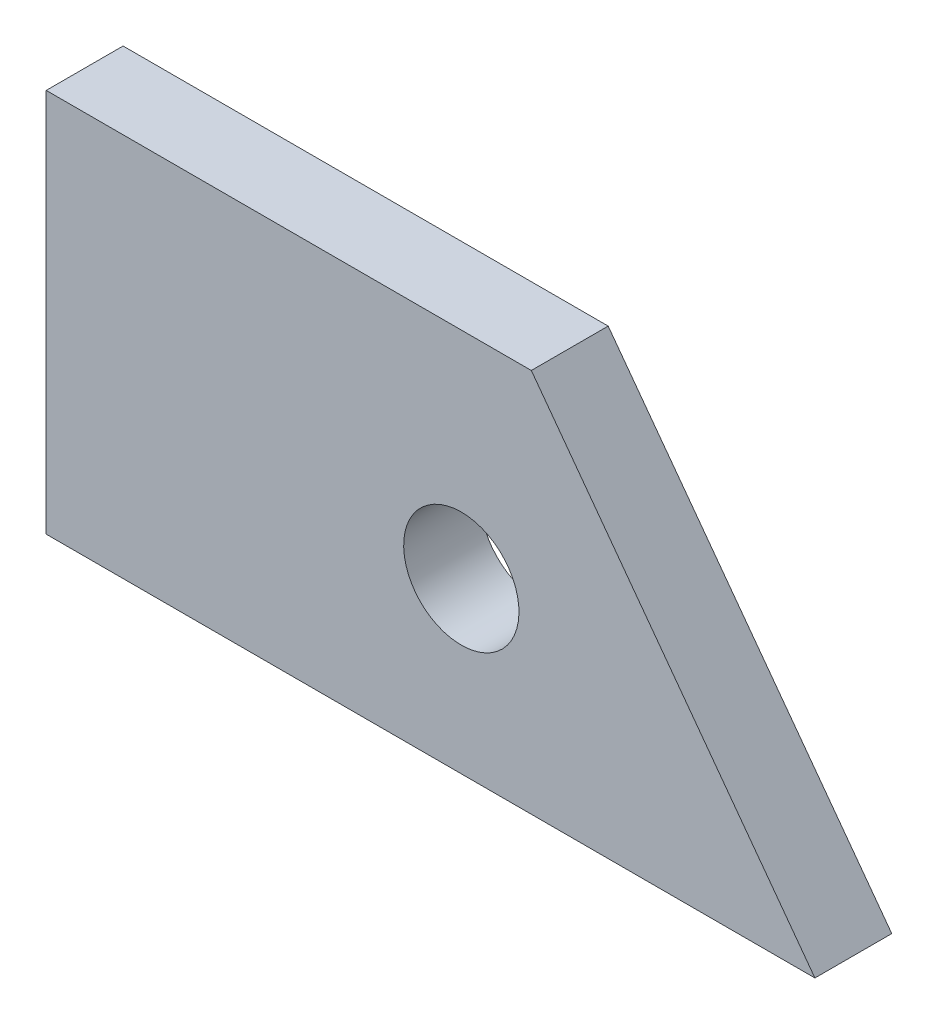
ISO-10303-21;
HEADER;
FILE_DESCRIPTION(('STEP AP214'),'2;1');
FILE_NAME('part.step','',(''),(''),'','','');
FILE_SCHEMA(('AUTOMOTIVE_DESIGN { 1 0 10303 214 1 1 1 1 }'));
ENDSEC;
DATA;
#1=APPLICATION_CONTEXT('core data for automotive mechanical design processes');
#2=APPLICATION_PROTOCOL_DEFINITION('international standard','automotive_design',2000,#1);
#3=PRODUCT_CONTEXT('',#1,'mechanical');
#4=PRODUCT('Part','Part','',(#3));
#5=PRODUCT_RELATED_PRODUCT_CATEGORY('part','',(#4));
#6=PRODUCT_DEFINITION_FORMATION('','',#4);
#7=PRODUCT_DEFINITION_CONTEXT('part definition',#1,'design');
#8=PRODUCT_DEFINITION('design','',#6,#7);
#9=PRODUCT_DEFINITION_SHAPE('','',#8);
#10=(LENGTH_UNIT() NAMED_UNIT(*) SI_UNIT(.MILLI.,.METRE.));
#11=(NAMED_UNIT(*) PLANE_ANGLE_UNIT() SI_UNIT($,.RADIAN.));
#12=(NAMED_UNIT(*) SI_UNIT($,.STERADIAN.) SOLID_ANGLE_UNIT());
#13=UNCERTAINTY_MEASURE_WITH_UNIT(LENGTH_MEASURE(1.E-05),#10,'distance_accuracy_value','');
#14=(GEOMETRIC_REPRESENTATION_CONTEXT(3) GLOBAL_UNCERTAINTY_ASSIGNED_CONTEXT((#13)) GLOBAL_UNIT_ASSIGNED_CONTEXT((#10,
#11,#12)) REPRESENTATION_CONTEXT('',''));
#15=CARTESIAN_POINT('',(0.,0.,0.));
#16=DIRECTION('',(0.,0.,1.));
#17=DIRECTION('',(1.,0.,0.));
#18=AXIS2_PLACEMENT_3D('',#15,#16,#17);
#19=CARTESIAN_POINT('',(114.,0.,-32.5));
#20=DIRECTION('',(0.,0.,1.));
#21=DIRECTION('',(0.,-1.,0.));
#22=AXIS2_PLACEMENT_3D('',#19,#20,#21);
#23=PLANE('',#22);
#24=DIRECTION('',(-1.,0.,0.));
#25=VECTOR('',#24,1.);
#26=CARTESIAN_POINT('',(114.,50.,-32.4999999999999));
#27=LINE('',#26,#25);
#28=CARTESIAN_POINT('',(77.1063365704997,50.,-32.4999999999998));
#29=VERTEX_POINT('',#28);
#30=CARTESIAN_POINT('',(14.,50.,-32.4999999999998));
#31=VERTEX_POINT('',#30);
#32=EDGE_CURVE('E44',#29,#31,#27,.T.);
#33=ORIENTED_EDGE('',*,*,#32,.F.);
#34=DIRECTION('',(-0.593736669502456,0.804659410737321,0.));
#35=VECTOR('',#34,1.);
#36=CARTESIAN_POINT('',(114.,0.,-32.5));
#37=LINE('',#36,#35);
#38=CARTESIAN_POINT('',(114.,0.,-32.5));
#39=VERTEX_POINT('',#38);
#40=EDGE_CURVE('E102',#39,#29,#37,.T.);
#41=ORIENTED_EDGE('',*,*,#40,.F.);
#42=DIRECTION('',(-1.,0.,0.));
#43=VECTOR('',#42,1.);
#44=CARTESIAN_POINT('',(114.,0.,-32.5));
#45=LINE('',#44,#43);
#46=CARTESIAN_POINT('',(14.,0.,-32.5));
#47=VERTEX_POINT('',#46);
#48=EDGE_CURVE('E11',#39,#47,#45,.T.);
#49=ORIENTED_EDGE('',*,*,#48,.T.);
#50=DIRECTION('',(0.,1.,0.));
#51=VECTOR('',#50,1.);
#52=CARTESIAN_POINT('',(14.,0.,-32.5));
#53=LINE('',#52,#51);
#54=EDGE_CURVE('E83',#47,#31,#53,.T.);
#55=ORIENTED_EDGE('',*,*,#54,.T.);
#56=EDGE_LOOP('',(#33,#41,#49,#55));
#57=FACE_BOUND('',#56,.T.);
#58=CARTESIAN_POINT('',(68.,22.,-32.4999999999999));
#59=DIRECTION('',(0.,0.,-1.));
#60=DIRECTION('',(0.,1.,0.));
#61=AXIS2_PLACEMENT_3D('',#58,#59,#60);
#62=CIRCLE('',#61,7.49999999999999);
#63=CARTESIAN_POINT('',(68.,29.5,-32.4999999999999));
#64=VERTEX_POINT('',#63);
#65=EDGE_CURVE('E111',#64,#64,#62,.T.);
#66=ORIENTED_EDGE('',*,*,#65,.F.);
#67=EDGE_LOOP('',(#66));
#68=FACE_BOUND('',#67,.T.);
#69=ADVANCED_FACE('F35',(#57,#68),#23,.F.);
#70=CARTESIAN_POINT('',(114.,0.,-32.5));
#71=DIRECTION('',(0.,1.,0.));
#72=DIRECTION('',(0.,0.,1.));
#73=AXIS2_PLACEMENT_3D('',#70,#71,#72);
#74=PLANE('',#73);
#75=DIRECTION('',(0.,0.,-1.));
#76=VECTOR('',#75,1.);
#77=CARTESIAN_POINT('',(14.,0.,-32.5));
#78=LINE('',#77,#76);
#79=CARTESIAN_POINT('',(14.,0.,-22.5));
#80=VERTEX_POINT('',#79);
#81=EDGE_CURVE('E88',#80,#47,#78,.T.);
#82=ORIENTED_EDGE('',*,*,#81,.T.);
#83=ORIENTED_EDGE('',*,*,#48,.F.);
#84=DIRECTION('',(0.,0.,-1.));
#85=VECTOR('',#84,1.);
#86=CARTESIAN_POINT('',(114.,0.,-32.5));
#87=LINE('',#86,#85);
#88=CARTESIAN_POINT('',(114.,0.,-22.5));
#89=VERTEX_POINT('',#88);
#90=EDGE_CURVE('E89',#89,#39,#87,.T.);
#91=ORIENTED_EDGE('',*,*,#90,.F.);
#92=DIRECTION('',(-1.,0.,0.));
#93=VECTOR('',#92,1.);
#94=CARTESIAN_POINT('',(114.,0.,-22.5));
#95=LINE('',#94,#93);
#96=EDGE_CURVE('E75',#89,#80,#95,.T.);
#97=ORIENTED_EDGE('',*,*,#96,.T.);
#98=EDGE_LOOP('',(#82,#83,#91,#97));
#99=FACE_BOUND('',#98,.T.);
#100=ADVANCED_FACE('F37',(#99),#74,.F.);
#101=CARTESIAN_POINT('',(114.,50.,-22.4999999999998));
#102=DIRECTION('',(0.,-1.,0.));
#103=DIRECTION('',(0.,0.,-1.));
#104=AXIS2_PLACEMENT_3D('',#101,#102,#103);
#105=PLANE('',#104);
#106=DIRECTION('',(-1.,0.,0.));
#107=VECTOR('',#106,1.);
#108=CARTESIAN_POINT('',(114.,50.,-22.4999999999998));
#109=LINE('',#108,#107);
#110=CARTESIAN_POINT('',(77.1063365704997,50.,-22.4999999999999));
#111=VERTEX_POINT('',#110);
#112=CARTESIAN_POINT('',(14.,50.,-22.4999999999998));
#113=VERTEX_POINT('',#112);
#114=EDGE_CURVE('E67',#111,#113,#109,.T.);
#115=ORIENTED_EDGE('',*,*,#114,.F.);
#116=DIRECTION('',(0.,0.,-1.));
#117=VECTOR('',#116,1.);
#118=CARTESIAN_POINT('',(77.1063365704997,49.9999999999998,24.0000000000002));
#119=LINE('',#118,#117);
#120=EDGE_CURVE('E106',#111,#29,#119,.T.);
#121=ORIENTED_EDGE('',*,*,#120,.T.);
#122=ORIENTED_EDGE('',*,*,#32,.T.);
#123=DIRECTION('',(0.,0.,1.));
#124=VECTOR('',#123,1.);
#125=CARTESIAN_POINT('',(14.,50.,-22.4999999999998));
#126=LINE('',#125,#124);
#127=EDGE_CURVE('E78',#31,#113,#126,.T.);
#128=ORIENTED_EDGE('',*,*,#127,.T.);
#129=EDGE_LOOP('',(#115,#121,#122,#128));
#130=FACE_BOUND('',#129,.T.);
#131=ADVANCED_FACE('F79',(#130),#105,.F.);
#132=CARTESIAN_POINT('',(114.,0.,-22.5));
#133=DIRECTION('',(0.,0.,-1.));
#134=DIRECTION('',(0.,1.,0.));
#135=AXIS2_PLACEMENT_3D('',#132,#133,#134);
#136=PLANE('',#135);
#137=CARTESIAN_POINT('',(68.,22.,-22.4999999999999));
#138=DIRECTION('',(0.,0.,-1.));
#139=DIRECTION('',(0.,1.,0.));
#140=AXIS2_PLACEMENT_3D('',#137,#138,#139);
#141=CIRCLE('',#140,7.49999999999999);
#142=CARTESIAN_POINT('',(68.,29.5,-22.4999999999999));
#143=VERTEX_POINT('',#142);
#144=EDGE_CURVE('E107',#143,#143,#141,.T.);
#145=ORIENTED_EDGE('',*,*,#144,.T.);
#146=EDGE_LOOP('',(#145));
#147=FACE_BOUND('',#146,.T.);
#148=ORIENTED_EDGE('',*,*,#96,.F.);
#149=DIRECTION('',(-0.593736669502456,0.804659410737321,0.));
#150=VECTOR('',#149,1.);
#151=CARTESIAN_POINT('',(114.,0.,-22.5));
#152=LINE('',#151,#150);
#153=EDGE_CURVE('E51',#89,#111,#152,.T.);
#154=ORIENTED_EDGE('',*,*,#153,.T.);
#155=ORIENTED_EDGE('',*,*,#114,.T.);
#156=DIRECTION('',(0.,-1.,0.));
#157=VECTOR('',#156,1.);
#158=CARTESIAN_POINT('',(14.,0.,-22.5));
#159=LINE('',#158,#157);
#160=EDGE_CURVE('E71',#113,#80,#159,.T.);
#161=ORIENTED_EDGE('',*,*,#160,.T.);
#162=EDGE_LOOP('',(#148,#154,#155,#161));
#163=FACE_BOUND('',#162,.T.);
#164=ADVANCED_FACE('F69',(#147,#163),#136,.F.);
#165=CARTESIAN_POINT('',(14.,25.,-4.99999999999991));
#166=DIRECTION('',(-1.,0.,0.));
#167=DIRECTION('',(0.,-1.,0.));
#168=AXIS2_PLACEMENT_3D('',#165,#166,#167);
#169=PLANE('',#168);
#170=ORIENTED_EDGE('',*,*,#81,.F.);
#171=ORIENTED_EDGE('',*,*,#160,.F.);
#172=ORIENTED_EDGE('',*,*,#127,.F.);
#173=ORIENTED_EDGE('',*,*,#54,.F.);
#174=EDGE_LOOP('',(#170,#171,#172,#173));
#175=FACE_BOUND('',#174,.T.);
#176=ADVANCED_FACE('F86',(#175),#169,.T.);
#177=CARTESIAN_POINT('',(114.,-1.75189044089975E-13,24.));
#178=DIRECTION('',(-0.80465941073732,-0.593736669502456,0.));
#179=DIRECTION('',(0.593736669502456,-0.804659410737321,0.));
#180=AXIS2_PLACEMENT_3D('',#177,#178,#179);
#181=PLANE('',#180);
#182=ORIENTED_EDGE('',*,*,#90,.T.);
#183=ORIENTED_EDGE('',*,*,#40,.T.);
#184=ORIENTED_EDGE('',*,*,#120,.F.);
#185=ORIENTED_EDGE('',*,*,#153,.F.);
#186=EDGE_LOOP('',(#182,#183,#184,#185));
#187=FACE_BOUND('',#186,.T.);
#188=ADVANCED_FACE('F100',(#187),#181,.F.);
#189=CARTESIAN_POINT('',(68.,22.,-32.4999999999999));
#190=DIRECTION('',(0.,0.,-1.));
#191=DIRECTION('',(0.,1.,0.));
#192=AXIS2_PLACEMENT_3D('',#189,#190,#191);
#193=CYLINDRICAL_SURFACE('',#192,7.49999999999999);
#194=ORIENTED_EDGE('',*,*,#144,.F.);
#195=EDGE_LOOP('',(#194));
#196=FACE_BOUND('',#195,.T.);
#197=ORIENTED_EDGE('',*,*,#65,.T.);
#198=EDGE_LOOP('',(#197));
#199=FACE_BOUND('',#198,.T.);
#200=ADVANCED_FACE('F119',(#196,#199),#193,.F.);
#201=CLOSED_SHELL('',(#69,#100,#131,#164,#176,#188,#200));
#202=MANIFOLD_SOLID_BREP('B2',#201);
#203=ADVANCED_BREP_SHAPE_REPRESENTATION('',(#18,#202),#14);
#204=SHAPE_DEFINITION_REPRESENTATION(#9,#203);
ENDSEC;
END-ISO-10303-21;
